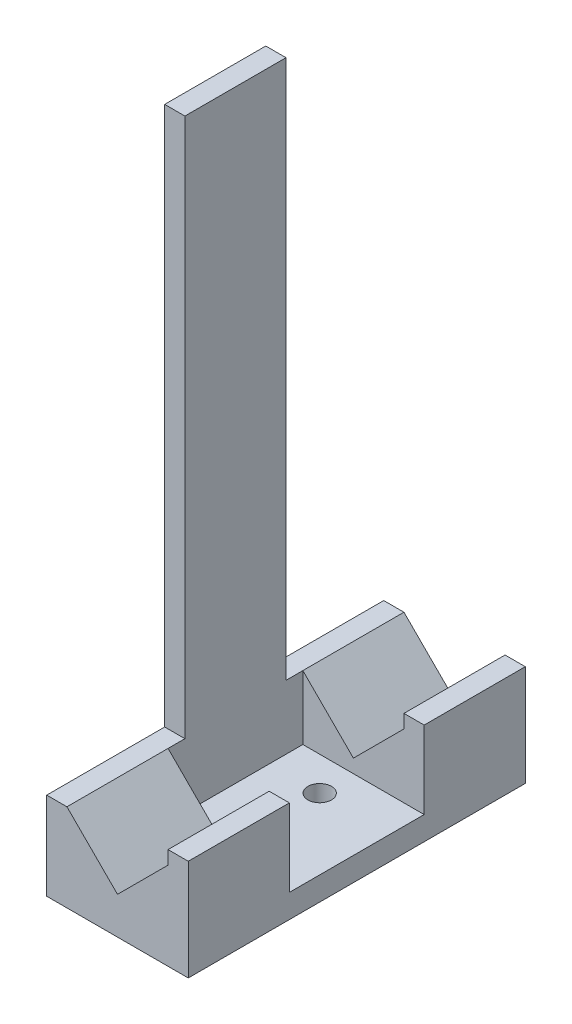
ISO-10303-21;
HEADER;
FILE_DESCRIPTION(('STEP AP214'),'2;1');
FILE_NAME('part.step','',(''),(''),'','','');
FILE_SCHEMA(('AUTOMOTIVE_DESIGN { 1 0 10303 214 1 1 1 1 }'));
ENDSEC;
DATA;
#1=APPLICATION_CONTEXT('core data for automotive mechanical design processes');
#2=APPLICATION_PROTOCOL_DEFINITION('international standard','automotive_design',2000,#1);
#3=PRODUCT_CONTEXT('',#1,'mechanical');
#4=PRODUCT('Part','Part','',(#3));
#5=PRODUCT_RELATED_PRODUCT_CATEGORY('part','',(#4));
#6=PRODUCT_DEFINITION_FORMATION('','',#4);
#7=PRODUCT_DEFINITION_CONTEXT('part definition',#1,'design');
#8=PRODUCT_DEFINITION('design','',#6,#7);
#9=PRODUCT_DEFINITION_SHAPE('','',#8);
#10=(LENGTH_UNIT() NAMED_UNIT(*) SI_UNIT(.MILLI.,.METRE.));
#11=(NAMED_UNIT(*) PLANE_ANGLE_UNIT() SI_UNIT($,.RADIAN.));
#12=(NAMED_UNIT(*) SI_UNIT($,.STERADIAN.) SOLID_ANGLE_UNIT());
#13=UNCERTAINTY_MEASURE_WITH_UNIT(LENGTH_MEASURE(1.E-05),#10,'distance_accuracy_value','');
#14=(GEOMETRIC_REPRESENTATION_CONTEXT(3) GLOBAL_UNCERTAINTY_ASSIGNED_CONTEXT((#13)) GLOBAL_UNIT_ASSIGNED_CONTEXT((#10,
#11,#12)) REPRESENTATION_CONTEXT('',''));
#15=CARTESIAN_POINT('',(0.,0.,0.));
#16=DIRECTION('',(0.,0.,1.));
#17=DIRECTION('',(1.,0.,0.));
#18=AXIS2_PLACEMENT_3D('',#15,#16,#17);
#19=CARTESIAN_POINT('',(18.0000000000001,15.,50.));
#20=DIRECTION('',(0.,-1.,0.));
#21=DIRECTION('',(1.,0.,0.));
#22=AXIS2_PLACEMENT_3D('',#19,#20,#21);
#23=PLANE('',#22);
#24=DIRECTION('',(0.,0.,-1.));
#25=VECTOR('',#24,1.);
#26=CARTESIAN_POINT('',(18.0000000000001,15.,50.));
#27=LINE('',#26,#25);
#28=CARTESIAN_POINT('',(18.0000000000001,15.,15.));
#29=VERTEX_POINT('',#28);
#30=CARTESIAN_POINT('',(18.0000000000001,15.,0.));
#31=VERTEX_POINT('',#30);
#32=EDGE_CURVE('E238',#29,#31,#27,.T.);
#33=ORIENTED_EDGE('',*,*,#32,.F.);
#34=DIRECTION('',(1.,0.,0.));
#35=VECTOR('',#34,1.);
#36=CARTESIAN_POINT('',(-20.0705439901186,15.,15.));
#37=LINE('',#36,#35);
#38=CARTESIAN_POINT('',(21.0000000000001,15.,15.));
#39=VERTEX_POINT('',#38);
#40=EDGE_CURVE('E288',#29,#39,#37,.T.);
#41=ORIENTED_EDGE('',*,*,#40,.T.);
#42=DIRECTION('',(0.,0.,-1.));
#43=VECTOR('',#42,1.);
#44=CARTESIAN_POINT('',(21.0000000000001,15.,50.));
#45=LINE('',#44,#43);
#46=CARTESIAN_POINT('',(21.0000000000001,15.,0.));
#47=VERTEX_POINT('',#46);
#48=EDGE_CURVE('E242',#39,#47,#45,.T.);
#49=ORIENTED_EDGE('',*,*,#48,.T.);
#50=DIRECTION('',(-1.,0.,0.));
#51=VECTOR('',#50,1.);
#52=CARTESIAN_POINT('',(18.0000000000001,15.,0.));
#53=LINE('',#52,#51);
#54=EDGE_CURVE('E354',#47,#31,#53,.T.);
#55=ORIENTED_EDGE('',*,*,#54,.T.);
#56=EDGE_LOOP('',(#33,#41,#49,#55));
#57=FACE_BOUND('',#56,.T.);
#58=ADVANCED_FACE('F32',(#57),#23,.F.);
#59=CARTESIAN_POINT('',(18.0000000000001,13.,50.));
#60=DIRECTION('',(1.,0.,0.));
#61=DIRECTION('',(0.,1.,0.));
#62=AXIS2_PLACEMENT_3D('',#59,#60,#61);
#63=PLANE('',#62);
#64=DIRECTION('',(0.,0.,-1.));
#65=VECTOR('',#64,1.);
#66=CARTESIAN_POINT('',(18.0000000000001,13.,50.));
#67=LINE('',#66,#65);
#68=CARTESIAN_POINT('',(18.0000000000001,13.,15.));
#69=VERTEX_POINT('',#68);
#70=CARTESIAN_POINT('',(18.0000000000001,13.,0.));
#71=VERTEX_POINT('',#70);
#72=EDGE_CURVE('E234',#69,#71,#67,.T.);
#73=ORIENTED_EDGE('',*,*,#72,.F.);
#74=DIRECTION('',(0.,1.,0.));
#75=VECTOR('',#74,1.);
#76=CARTESIAN_POINT('',(18.0000000000001,13.,15.));
#77=LINE('',#76,#75);
#78=EDGE_CURVE('E303',#69,#29,#77,.T.);
#79=ORIENTED_EDGE('',*,*,#78,.T.);
#80=ORIENTED_EDGE('',*,*,#32,.T.);
#81=DIRECTION('',(0.,-1.,0.));
#82=VECTOR('',#81,1.);
#83=CARTESIAN_POINT('',(18.0000000000001,13.,0.));
#84=LINE('',#83,#82);
#85=EDGE_CURVE('E357',#31,#71,#84,.T.);
#86=ORIENTED_EDGE('',*,*,#85,.T.);
#87=EDGE_LOOP('',(#73,#79,#80,#86));
#88=FACE_BOUND('',#87,.T.);
#89=ADVANCED_FACE('F409',(#88),#63,.F.);
#90=CARTESIAN_POINT('',(18.0000000000001,13.,50.));
#91=DIRECTION('',(0.707106781186548,-0.707106781186547,0.));
#92=DIRECTION('',(0.707106781186547,0.707106781186548,0.));
#93=AXIS2_PLACEMENT_3D('',#90,#91,#92);
#94=PLANE('',#93);
#95=DIRECTION('',(0.,0.,-1.));
#96=VECTOR('',#95,1.);
#97=CARTESIAN_POINT('',(10.5000000000001,5.5,50.));
#98=LINE('',#97,#96);
#99=CARTESIAN_POINT('',(10.5000000000001,5.5,15.));
#100=VERTEX_POINT('',#99);
#101=CARTESIAN_POINT('',(10.5000000000001,5.5,0.));
#102=VERTEX_POINT('',#101);
#103=EDGE_CURVE('E230',#100,#102,#98,.T.);
#104=ORIENTED_EDGE('',*,*,#103,.F.);
#105=DIRECTION('',(0.707106781186547,0.707106781186548,0.));
#106=VECTOR('',#105,1.);
#107=CARTESIAN_POINT('',(18.0000000000001,13.,15.));
#108=LINE('',#107,#106);
#109=EDGE_CURVE('E300',#100,#69,#108,.T.);
#110=ORIENTED_EDGE('',*,*,#109,.T.);
#111=ORIENTED_EDGE('',*,*,#72,.T.);
#112=DIRECTION('',(-0.707106781186547,-0.707106781186548,0.));
#113=VECTOR('',#112,1.);
#114=CARTESIAN_POINT('',(18.0000000000001,13.,0.));
#115=LINE('',#114,#113);
#116=EDGE_CURVE('E360',#71,#102,#115,.T.);
#117=ORIENTED_EDGE('',*,*,#116,.T.);
#118=EDGE_LOOP('',(#104,#110,#111,#117));
#119=FACE_BOUND('',#118,.T.);
#120=ADVANCED_FACE('F415',(#119),#94,.F.);
#121=CARTESIAN_POINT('',(10.5000000000001,5.5,50.));
#122=DIRECTION('',(-0.707106781186548,-0.707106781186548,0.));
#123=DIRECTION('',(0.707106781186548,-0.707106781186548,0.));
#124=AXIS2_PLACEMENT_3D('',#121,#122,#123);
#125=PLANE('',#124);
#126=DIRECTION('',(0.,0.,-1.));
#127=VECTOR('',#126,1.);
#128=CARTESIAN_POINT('',(3.00000000000007,13.,0.));
#129=LINE('',#128,#127);
#130=CARTESIAN_POINT('',(3.00000000000006,13.,15.));
#131=VERTEX_POINT('',#130);
#132=CARTESIAN_POINT('',(3.00000000000006,13.,0.));
#133=VERTEX_POINT('',#132);
#134=EDGE_CURVE('E320',#131,#133,#129,.T.);
#135=ORIENTED_EDGE('',*,*,#134,.F.);
#136=DIRECTION('',(0.707106781186548,-0.707106781186548,0.));
#137=VECTOR('',#136,1.);
#138=CARTESIAN_POINT('',(10.5000000000001,5.5,15.));
#139=LINE('',#138,#137);
#140=EDGE_CURVE('E11',#131,#100,#139,.T.);
#141=ORIENTED_EDGE('',*,*,#140,.T.);
#142=ORIENTED_EDGE('',*,*,#103,.T.);
#143=DIRECTION('',(-0.707106781186548,0.707106781186548,0.));
#144=VECTOR('',#143,1.);
#145=CARTESIAN_POINT('',(10.5000000000001,5.5,0.));
#146=LINE('',#145,#144);
#147=EDGE_CURVE('E363',#102,#133,#146,.T.);
#148=ORIENTED_EDGE('',*,*,#147,.T.);
#149=EDGE_LOOP('',(#135,#141,#142,#148));
#150=FACE_BOUND('',#149,.T.);
#151=ADVANCED_FACE('F488',(#150),#125,.F.);
#152=CARTESIAN_POINT('',(0.,0.,50.));
#153=DIRECTION('',(0.,0.,-1.));
#154=DIRECTION('',(-1.,0.,0.));
#155=AXIS2_PLACEMENT_3D('',#152,#153,#154);
#156=PLANE('',#155);
#157=DIRECTION('',(1.,0.,0.));
#158=VECTOR('',#157,1.);
#159=CARTESIAN_POINT('',(0.,13.,50.));
#160=LINE('',#159,#158);
#161=CARTESIAN_POINT('',(0.,13.,50.));
#162=VERTEX_POINT('',#161);
#163=CARTESIAN_POINT('',(3.00000000000007,13.,50.));
#164=VERTEX_POINT('',#163);
#165=EDGE_CURVE('E249',#162,#164,#160,.T.);
#166=ORIENTED_EDGE('',*,*,#165,.F.);
#167=DIRECTION('',(0.,-1.,0.));
#168=VECTOR('',#167,1.);
#169=CARTESIAN_POINT('',(0.,4.,50.));
#170=LINE('',#169,#168);
#171=CARTESIAN_POINT('',(0.,0.,50.));
#172=VERTEX_POINT('',#171);
#173=EDGE_CURVE('E347',#162,#172,#170,.T.);
#174=ORIENTED_EDGE('',*,*,#173,.T.);
#175=DIRECTION('',(1.,0.,0.));
#176=VECTOR('',#175,1.);
#177=CARTESIAN_POINT('',(21.,0.,50.));
#178=LINE('',#177,#176);
#179=CARTESIAN_POINT('',(21.,0.,50.));
#180=VERTEX_POINT('',#179);
#181=EDGE_CURVE('E349',#172,#180,#178,.T.);
#182=ORIENTED_EDGE('',*,*,#181,.T.);
#183=DIRECTION('',(0.,1.,0.));
#184=VECTOR('',#183,1.);
#185=CARTESIAN_POINT('',(21.,0.,50.));
#186=LINE('',#185,#184);
#187=CARTESIAN_POINT('',(21.0000000000001,15.,50.));
#188=VERTEX_POINT('',#187);
#189=EDGE_CURVE('E334',#180,#188,#186,.T.);
#190=ORIENTED_EDGE('',*,*,#189,.T.);
#191=DIRECTION('',(-1.,0.,0.));
#192=VECTOR('',#191,1.);
#193=CARTESIAN_POINT('',(18.0000000000001,15.,50.));
#194=LINE('',#193,#192);
#195=CARTESIAN_POINT('',(18.0000000000001,15.,50.));
#196=VERTEX_POINT('',#195);
#197=EDGE_CURVE('E337',#188,#196,#194,.T.);
#198=ORIENTED_EDGE('',*,*,#197,.T.);
#199=DIRECTION('',(0.,-1.,0.));
#200=VECTOR('',#199,1.);
#201=CARTESIAN_POINT('',(18.0000000000001,13.,50.));
#202=LINE('',#201,#200);
#203=CARTESIAN_POINT('',(18.0000000000001,13.,50.));
#204=VERTEX_POINT('',#203);
#205=EDGE_CURVE('E340',#196,#204,#202,.T.);
#206=ORIENTED_EDGE('',*,*,#205,.T.);
#207=DIRECTION('',(-0.707106781186547,-0.707106781186548,0.));
#208=VECTOR('',#207,1.);
#209=CARTESIAN_POINT('',(18.0000000000001,13.,50.));
#210=LINE('',#209,#208);
#211=CARTESIAN_POINT('',(10.5000000000001,5.5,50.));
#212=VERTEX_POINT('',#211);
#213=EDGE_CURVE('E342',#204,#212,#210,.T.);
#214=ORIENTED_EDGE('',*,*,#213,.T.);
#215=DIRECTION('',(-0.707106781186548,0.707106781186548,0.));
#216=VECTOR('',#215,1.);
#217=CARTESIAN_POINT('',(10.5000000000001,5.5,50.));
#218=LINE('',#217,#216);
#219=EDGE_CURVE('E344',#212,#164,#218,.T.);
#220=ORIENTED_EDGE('',*,*,#219,.T.);
#221=EDGE_LOOP('',(#166,#174,#182,#190,#198,#206,#214,#220));
#222=FACE_BOUND('',#221,.T.);
#223=ADVANCED_FACE('F450',(#222),#156,.F.);
#224=CARTESIAN_POINT('',(0.,0.,0.));
#225=DIRECTION('',(0.,0.,-1.));
#226=DIRECTION('',(-1.,0.,0.));
#227=AXIS2_PLACEMENT_3D('',#224,#225,#226);
#228=PLANE('',#227);
#229=DIRECTION('',(0.,-1.,0.));
#230=VECTOR('',#229,1.);
#231=CARTESIAN_POINT('',(0.,4.,0.));
#232=LINE('',#231,#230);
#233=CARTESIAN_POINT('',(1.01481323344643E-13,13.,0.));
#234=VERTEX_POINT('',#233);
#235=CARTESIAN_POINT('',(0.,0.,0.));
#236=VERTEX_POINT('',#235);
#237=EDGE_CURVE('E366',#234,#236,#232,.T.);
#238=ORIENTED_EDGE('',*,*,#237,.F.);
#239=DIRECTION('',(-1.,0.,0.));
#240=VECTOR('',#239,1.);
#241=CARTESIAN_POINT('',(-2.99999999999952,13.,0.));
#242=LINE('',#241,#240);
#243=EDGE_CURVE('E324',#133,#234,#242,.T.);
#244=ORIENTED_EDGE('',*,*,#243,.F.);
#245=ORIENTED_EDGE('',*,*,#147,.F.);
#246=ORIENTED_EDGE('',*,*,#116,.F.);
#247=ORIENTED_EDGE('',*,*,#85,.F.);
#248=ORIENTED_EDGE('',*,*,#54,.F.);
#249=DIRECTION('',(0.,1.,0.));
#250=VECTOR('',#249,1.);
#251=CARTESIAN_POINT('',(21.,0.,0.));
#252=LINE('',#251,#250);
#253=CARTESIAN_POINT('',(21.,0.,0.));
#254=VERTEX_POINT('',#253);
#255=EDGE_CURVE('E333',#254,#47,#252,.T.);
#256=ORIENTED_EDGE('',*,*,#255,.F.);
#257=DIRECTION('',(1.,0.,0.));
#258=VECTOR('',#257,1.);
#259=CARTESIAN_POINT('',(21.,0.,0.));
#260=LINE('',#259,#258);
#261=EDGE_CURVE('E338',#236,#254,#260,.T.);
#262=ORIENTED_EDGE('',*,*,#261,.F.);
#263=EDGE_LOOP('',(#238,#244,#245,#246,#247,#248,#256,#262));
#264=FACE_BOUND('',#263,.T.);
#265=ADVANCED_FACE('F428',(#264),#228,.T.);
#266=CARTESIAN_POINT('',(21.,0.,50.));
#267=DIRECTION('',(-1.,0.,0.));
#268=DIRECTION('',(0.,-1.,0.));
#269=AXIS2_PLACEMENT_3D('',#266,#267,#268);
#270=PLANE('',#269);
#271=ORIENTED_EDGE('',*,*,#48,.F.);
#272=DIRECTION('',(0.,1.,0.));
#273=VECTOR('',#272,1.);
#274=CARTESIAN_POINT('',(21.0000000000001,15.,15.));
#275=LINE('',#274,#273);
#276=CARTESIAN_POINT('',(21.,3.49999999999998,15.));
#277=VERTEX_POINT('',#276);
#278=EDGE_CURVE('E273',#277,#39,#275,.T.);
#279=ORIENTED_EDGE('',*,*,#278,.F.);
#280=DIRECTION('',(0.,0.,-1.));
#281=VECTOR('',#280,1.);
#282=CARTESIAN_POINT('',(21.,3.49999999999998,35.));
#283=LINE('',#282,#281);
#284=CARTESIAN_POINT('',(21.,3.49999999999998,35.));
#285=VERTEX_POINT('',#284);
#286=EDGE_CURVE('E262',#285,#277,#283,.T.);
#287=ORIENTED_EDGE('',*,*,#286,.F.);
#288=DIRECTION('',(0.,-1.,0.));
#289=VECTOR('',#288,1.);
#290=CARTESIAN_POINT('',(21.0000000000001,15.,35.));
#291=LINE('',#290,#289);
#292=CARTESIAN_POINT('',(21.0000000000001,15.,35.));
#293=VERTEX_POINT('',#292);
#294=EDGE_CURVE('E257',#293,#285,#291,.T.);
#295=ORIENTED_EDGE('',*,*,#294,.F.);
#296=EDGE_CURVE('E243',#188,#293,#45,.T.);
#297=ORIENTED_EDGE('',*,*,#296,.F.);
#298=ORIENTED_EDGE('',*,*,#189,.F.);
#299=DIRECTION('',(0.,0.,-1.));
#300=VECTOR('',#299,1.);
#301=CARTESIAN_POINT('',(21.,0.,50.));
#302=LINE('',#301,#300);
#303=EDGE_CURVE('E351',#180,#254,#302,.T.);
#304=ORIENTED_EDGE('',*,*,#303,.T.);
#305=ORIENTED_EDGE('',*,*,#255,.T.);
#306=EDGE_LOOP('',(#271,#279,#287,#295,#297,#298,#304,#305));
#307=FACE_BOUND('',#306,.T.);
#308=ADVANCED_FACE('F34',(#307),#270,.F.);
#309=ORIENTED_EDGE('',*,*,#296,.T.);
#310=DIRECTION('',(1.,0.,0.));
#311=VECTOR('',#310,1.);
#312=CARTESIAN_POINT('',(-20.0705439901186,15.,35.));
#313=LINE('',#312,#311);
#314=CARTESIAN_POINT('',(18.0000000000001,15.,35.));
#315=VERTEX_POINT('',#314);
#316=EDGE_CURVE('E284',#315,#293,#313,.T.);
#317=ORIENTED_EDGE('',*,*,#316,.F.);
#318=EDGE_CURVE('E239',#196,#315,#27,.T.);
#319=ORIENTED_EDGE('',*,*,#318,.F.);
#320=ORIENTED_EDGE('',*,*,#197,.F.);
#321=EDGE_LOOP('',(#309,#317,#319,#320));
#322=FACE_BOUND('',#321,.T.);
#323=ADVANCED_FACE('F411',(#322),#23,.F.);
#324=ORIENTED_EDGE('',*,*,#318,.T.);
#325=DIRECTION('',(0.,-1.,0.));
#326=VECTOR('',#325,1.);
#327=CARTESIAN_POINT('',(18.0000000000001,13.,35.));
#328=LINE('',#327,#326);
#329=CARTESIAN_POINT('',(18.0000000000001,13.,35.));
#330=VERTEX_POINT('',#329);
#331=EDGE_CURVE('E297',#315,#330,#328,.T.);
#332=ORIENTED_EDGE('',*,*,#331,.T.);
#333=EDGE_CURVE('E235',#204,#330,#67,.T.);
#334=ORIENTED_EDGE('',*,*,#333,.F.);
#335=ORIENTED_EDGE('',*,*,#205,.F.);
#336=EDGE_LOOP('',(#324,#332,#334,#335));
#337=FACE_BOUND('',#336,.T.);
#338=ADVANCED_FACE('F418',(#337),#63,.F.);
#339=ORIENTED_EDGE('',*,*,#333,.T.);
#340=DIRECTION('',(-0.707106781186547,-0.707106781186548,0.));
#341=VECTOR('',#340,1.);
#342=CARTESIAN_POINT('',(18.0000000000001,13.,35.));
#343=LINE('',#342,#341);
#344=CARTESIAN_POINT('',(10.5000000000001,5.5,35.));
#345=VERTEX_POINT('',#344);
#346=EDGE_CURVE('E294',#330,#345,#343,.T.);
#347=ORIENTED_EDGE('',*,*,#346,.T.);
#348=EDGE_CURVE('E231',#212,#345,#98,.T.);
#349=ORIENTED_EDGE('',*,*,#348,.F.);
#350=ORIENTED_EDGE('',*,*,#213,.F.);
#351=EDGE_LOOP('',(#339,#347,#349,#350));
#352=FACE_BOUND('',#351,.T.);
#353=ADVANCED_FACE('F426',(#352),#94,.F.);
#354=ORIENTED_EDGE('',*,*,#348,.T.);
#355=DIRECTION('',(-0.707106781186548,0.707106781186548,0.));
#356=VECTOR('',#355,1.);
#357=CARTESIAN_POINT('',(10.5000000000001,5.5,35.));
#358=LINE('',#357,#356);
#359=CARTESIAN_POINT('',(3.00000000000006,13.,35.));
#360=VERTEX_POINT('',#359);
#361=EDGE_CURVE('E41',#345,#360,#358,.T.);
#362=ORIENTED_EDGE('',*,*,#361,.T.);
#363=DIRECTION('',(0.,0.,-1.));
#364=VECTOR('',#363,1.);
#365=CARTESIAN_POINT('',(3.00000000000006,13.,50.));
#366=LINE('',#365,#364);
#367=EDGE_CURVE('E227',#164,#360,#366,.T.);
#368=ORIENTED_EDGE('',*,*,#367,.F.);
#369=ORIENTED_EDGE('',*,*,#219,.F.);
#370=EDGE_LOOP('',(#354,#362,#368,#369));
#371=FACE_BOUND('',#370,.T.);
#372=ADVANCED_FACE('F475',(#371),#125,.F.);
#373=CARTESIAN_POINT('',(3.00000000000006,13.,50.));
#374=DIRECTION('',(-1.,0.,0.));
#375=DIRECTION('',(0.,-1.,0.));
#376=AXIS2_PLACEMENT_3D('',#373,#374,#375);
#377=PLANE('',#376);
#378=DIRECTION('',(0.,0.,-1.));
#379=VECTOR('',#378,1.);
#380=CARTESIAN_POINT('',(3.00000000000019,93.,50.));
#381=LINE('',#380,#379);
#382=CARTESIAN_POINT('',(3.00000000000044,93.,32.5));
#383=VERTEX_POINT('',#382);
#384=CARTESIAN_POINT('',(3.00000000000044,93.,17.5));
#385=VERTEX_POINT('',#384);
#386=EDGE_CURVE('E218',#383,#385,#381,.T.);
#387=ORIENTED_EDGE('',*,*,#386,.F.);
#388=DIRECTION('',(0.,1.,0.));
#389=VECTOR('',#388,1.);
#390=CARTESIAN_POINT('',(3.00000000000007,13.,32.5));
#391=LINE('',#390,#389);
#392=CARTESIAN_POINT('',(3.00000000000007,13.,32.5));
#393=VERTEX_POINT('',#392);
#394=EDGE_CURVE('E310',#393,#383,#391,.T.);
#395=ORIENTED_EDGE('',*,*,#394,.F.);
#396=EDGE_CURVE('E226',#360,#393,#366,.T.);
#397=ORIENTED_EDGE('',*,*,#396,.F.);
#398=DIRECTION('',(0.,-1.,0.));
#399=VECTOR('',#398,1.);
#400=CARTESIAN_POINT('',(3.00000000000007,15.,35.));
#401=LINE('',#400,#399);
#402=CARTESIAN_POINT('',(3.00000000000005,3.49999999999999,35.));
#403=VERTEX_POINT('',#402);
#404=EDGE_CURVE('E281',#360,#403,#401,.T.);
#405=ORIENTED_EDGE('',*,*,#404,.T.);
#406=DIRECTION('',(0.,0.,-1.));
#407=VECTOR('',#406,1.);
#408=CARTESIAN_POINT('',(3.00000000000005,3.49999999999999,35.));
#409=LINE('',#408,#407);
#410=CARTESIAN_POINT('',(3.00000000000005,3.49999999999999,15.));
#411=VERTEX_POINT('',#410);
#412=EDGE_CURVE('E275',#403,#411,#409,.T.);
#413=ORIENTED_EDGE('',*,*,#412,.T.);
#414=DIRECTION('',(0.,1.,0.));
#415=VECTOR('',#414,1.);
#416=CARTESIAN_POINT('',(3.00000000000007,15.,15.));
#417=LINE('',#416,#415);
#418=EDGE_CURVE('E285',#411,#131,#417,.T.);
#419=ORIENTED_EDGE('',*,*,#418,.T.);
#420=CARTESIAN_POINT('',(3.00000000000006,13.,17.5));
#421=VERTEX_POINT('',#420);
#422=EDGE_CURVE('E321',#421,#131,#129,.T.);
#423=ORIENTED_EDGE('',*,*,#422,.F.);
#424=DIRECTION('',(0.,1.,0.));
#425=VECTOR('',#424,1.);
#426=CARTESIAN_POINT('',(3.00000000000007,13.,17.5));
#427=LINE('',#426,#425);
#428=EDGE_CURVE('E327',#421,#385,#427,.T.);
#429=ORIENTED_EDGE('',*,*,#428,.T.);
#430=EDGE_LOOP('',(#387,#395,#397,#405,#413,#419,#423,#429));
#431=FACE_BOUND('',#430,.T.);
#432=ADVANCED_FACE('F471',(#431),#377,.F.);
#433=CARTESIAN_POINT('',(3.00000000000019,93.,50.));
#434=DIRECTION('',(0.,-1.,0.));
#435=DIRECTION('',(1.,0.,0.));
#436=AXIS2_PLACEMENT_3D('',#433,#434,#435);
#437=PLANE('',#436);
#438=DIRECTION('',(0.,0.,-1.));
#439=VECTOR('',#438,1.);
#440=CARTESIAN_POINT('',(1.9298798670242E-13,93.,50.));
#441=LINE('',#440,#439);
#442=CARTESIAN_POINT('',(1.9298798670242E-13,93.,32.5));
#443=VERTEX_POINT('',#442);
#444=CARTESIAN_POINT('',(1.9298798670242E-13,93.,17.5));
#445=VERTEX_POINT('',#444);
#446=EDGE_CURVE('E216',#443,#445,#441,.T.);
#447=ORIENTED_EDGE('',*,*,#446,.F.);
#448=DIRECTION('',(-1.,0.,0.));
#449=VECTOR('',#448,1.);
#450=CARTESIAN_POINT('',(-2.99999999999914,93.,32.5));
#451=LINE('',#450,#449);
#452=EDGE_CURVE('E306',#383,#443,#451,.T.);
#453=ORIENTED_EDGE('',*,*,#452,.F.);
#454=ORIENTED_EDGE('',*,*,#386,.T.);
#455=DIRECTION('',(1.,0.,0.));
#456=VECTOR('',#455,1.);
#457=CARTESIAN_POINT('',(-2.99999999999914,93.,17.5));
#458=LINE('',#457,#456);
#459=EDGE_CURVE('E316',#445,#385,#458,.T.);
#460=ORIENTED_EDGE('',*,*,#459,.F.);
#461=EDGE_LOOP('',(#447,#453,#454,#460));
#462=FACE_BOUND('',#461,.T.);
#463=ADVANCED_FACE('F505',(#462),#437,.F.);
#464=CARTESIAN_POINT('',(-2.99999999999999,4.,50.));
#465=DIRECTION('',(0.832050294337844,-0.554700196225229,0.));
#466=DIRECTION('',(0.554700196225229,0.832050294337844,0.));
#467=AXIS2_PLACEMENT_3D('',#464,#465,#466);
#468=PLANE('',#467);
#469=DIRECTION('',(0.,0.,-1.));
#470=VECTOR('',#469,1.);
#471=CARTESIAN_POINT('',(0.,8.5,50.));
#472=LINE('',#471,#470);
#473=CARTESIAN_POINT('',(0.,8.5,27.5));
#474=VERTEX_POINT('',#473);
#475=CARTESIAN_POINT('',(0.,8.5,22.5));
#476=VERTEX_POINT('',#475);
#477=EDGE_CURVE('E208',#474,#476,#472,.T.);
#478=ORIENTED_EDGE('',*,*,#477,.T.);
#479=DIRECTION('',(-0.554700196225229,-0.832050294337844,0.));
#480=VECTOR('',#479,1.);
#481=CARTESIAN_POINT('',(-2.99999999999999,4.,22.5));
#482=LINE('',#481,#480);
#483=CARTESIAN_POINT('',(-2.99999999999999,4.,22.5));
#484=VERTEX_POINT('',#483);
#485=EDGE_CURVE('E265',#476,#484,#482,.T.);
#486=ORIENTED_EDGE('',*,*,#485,.T.);
#487=DIRECTION('',(0.,0.,-1.));
#488=VECTOR('',#487,1.);
#489=CARTESIAN_POINT('',(-2.99999999999999,4.,50.));
#490=LINE('',#489,#488);
#491=CARTESIAN_POINT('',(-2.99999999999999,4.,27.5));
#492=VERTEX_POINT('',#491);
#493=EDGE_CURVE('E210',#492,#484,#490,.T.);
#494=ORIENTED_EDGE('',*,*,#493,.F.);
#495=DIRECTION('',(0.554700196225229,0.832050294337844,0.));
#496=VECTOR('',#495,1.);
#497=CARTESIAN_POINT('',(-2.99999999999999,4.,27.5));
#498=LINE('',#497,#496);
#499=EDGE_CURVE('E196',#492,#474,#498,.T.);
#500=ORIENTED_EDGE('',*,*,#499,.T.);
#501=EDGE_LOOP('',(#478,#486,#494,#500));
#502=FACE_BOUND('',#501,.T.);
#503=ADVANCED_FACE('F206',(#502),#468,.F.);
#504=CARTESIAN_POINT('',(-2.99999999999999,0.999999999999997,50.));
#505=DIRECTION('',(1.,0.,0.));
#506=DIRECTION('',(0.,1.,0.));
#507=AXIS2_PLACEMENT_3D('',#504,#505,#506);
#508=PLANE('',#507);
#509=ORIENTED_EDGE('',*,*,#493,.T.);
#510=DIRECTION('',(0.,1.,0.));
#511=VECTOR('',#510,1.);
#512=CARTESIAN_POINT('',(-2.99999999999999,0.,22.5));
#513=LINE('',#512,#511);
#514=CARTESIAN_POINT('',(-2.99999999999999,0.999999999999997,22.5));
#515=VERTEX_POINT('',#514);
#516=EDGE_CURVE('E388',#515,#484,#513,.T.);
#517=ORIENTED_EDGE('',*,*,#516,.F.);
#518=DIRECTION('',(0.,0.,-1.));
#519=VECTOR('',#518,1.);
#520=CARTESIAN_POINT('',(-2.99999999999999,0.999999999999997,50.));
#521=LINE('',#520,#519);
#522=CARTESIAN_POINT('',(-2.99999999999999,0.999999999999997,27.5));
#523=VERTEX_POINT('',#522);
#524=EDGE_CURVE('E220',#523,#515,#521,.T.);
#525=ORIENTED_EDGE('',*,*,#524,.F.);
#526=DIRECTION('',(0.,1.,0.));
#527=VECTOR('',#526,1.);
#528=CARTESIAN_POINT('',(-2.99999999999999,0.,27.5));
#529=LINE('',#528,#527);
#530=EDGE_CURVE('E201',#523,#492,#529,.T.);
#531=ORIENTED_EDGE('',*,*,#530,.T.);
#532=EDGE_LOOP('',(#509,#517,#525,#531));
#533=FACE_BOUND('',#532,.T.);
#534=ADVANCED_FACE('F387',(#533),#508,.F.);
#535=CARTESIAN_POINT('',(-2.99999999999999,0.999999999999997,50.));
#536=DIRECTION('',(0.,1.,0.));
#537=DIRECTION('',(0.,0.,1.));
#538=AXIS2_PLACEMENT_3D('',#535,#536,#537);
#539=PLANE('',#538);
#540=ORIENTED_EDGE('',*,*,#524,.T.);
#541=DIRECTION('',(1.,0.,0.));
#542=VECTOR('',#541,1.);
#543=CARTESIAN_POINT('',(-2.99999999999999,0.999999999999997,22.5));
#544=LINE('',#543,#542);
#545=CARTESIAN_POINT('',(-1.99999999999999,0.999999999999997,22.5));
#546=VERTEX_POINT('',#545);
#547=EDGE_CURVE('E269',#515,#546,#544,.T.);
#548=ORIENTED_EDGE('',*,*,#547,.T.);
#549=DIRECTION('',(0.,0.,-1.));
#550=VECTOR('',#549,1.);
#551=CARTESIAN_POINT('',(-1.99999999999999,0.999999999999997,50.));
#552=LINE('',#551,#550);
#553=CARTESIAN_POINT('',(-1.99999999999999,0.999999999999997,27.5));
#554=VERTEX_POINT('',#553);
#555=EDGE_CURVE('E376',#554,#546,#552,.T.);
#556=ORIENTED_EDGE('',*,*,#555,.F.);
#557=DIRECTION('',(-1.,0.,0.));
#558=VECTOR('',#557,1.);
#559=CARTESIAN_POINT('',(-2.99999999999999,0.999999999999997,27.5));
#560=LINE('',#559,#558);
#561=EDGE_CURVE('E212',#554,#523,#560,.T.);
#562=ORIENTED_EDGE('',*,*,#561,.T.);
#563=EDGE_LOOP('',(#540,#548,#556,#562));
#564=FACE_BOUND('',#563,.T.);
#565=ADVANCED_FACE('F383',(#564),#539,.F.);
#566=CARTESIAN_POINT('',(-1.99999999999999,0.999999999999997,50.));
#567=DIRECTION('',(-0.832050294337843,0.554700196225229,0.));
#568=DIRECTION('',(-0.554700196225229,-0.832050294337844,0.));
#569=AXIS2_PLACEMENT_3D('',#566,#567,#568);
#570=PLANE('',#569);
#571=ORIENTED_EDGE('',*,*,#555,.T.);
#572=DIRECTION('',(0.554700196225229,0.832050294337844,0.));
#573=VECTOR('',#572,1.);
#574=CARTESIAN_POINT('',(-1.99999999999999,0.999999999999997,22.5));
#575=LINE('',#574,#573);
#576=CARTESIAN_POINT('',(0.,4.,22.5));
#577=VERTEX_POINT('',#576);
#578=EDGE_CURVE('E211',#546,#577,#575,.T.);
#579=ORIENTED_EDGE('',*,*,#578,.T.);
#580=DIRECTION('',(0.,0.,-1.));
#581=VECTOR('',#580,1.);
#582=CARTESIAN_POINT('',(0.,4.,50.));
#583=LINE('',#582,#581);
#584=CARTESIAN_POINT('',(0.,4.,27.5));
#585=VERTEX_POINT('',#584);
#586=EDGE_CURVE('E374',#585,#577,#583,.T.);
#587=ORIENTED_EDGE('',*,*,#586,.F.);
#588=DIRECTION('',(-0.554700196225229,-0.832050294337844,0.));
#589=VECTOR('',#588,1.);
#590=CARTESIAN_POINT('',(-1.99999999999999,0.999999999999997,27.5));
#591=LINE('',#590,#589);
#592=EDGE_CURVE('E199',#585,#554,#591,.T.);
#593=ORIENTED_EDGE('',*,*,#592,.T.);
#594=EDGE_LOOP('',(#571,#579,#587,#593));
#595=FACE_BOUND('',#594,.T.);
#596=ADVANCED_FACE('F398',(#595),#570,.F.);
#597=CARTESIAN_POINT('',(0.,4.,50.));
#598=DIRECTION('',(1.,0.,0.));
#599=DIRECTION('',(0.,1.,0.));
#600=AXIS2_PLACEMENT_3D('',#597,#598,#599);
#601=PLANE('',#600);
#602=DIRECTION('',(0.,1.,0.));
#603=VECTOR('',#602,1.);
#604=CARTESIAN_POINT('',(0.,0.,22.5));
#605=LINE('',#604,#603);
#606=EDGE_CURVE('E49',#577,#476,#605,.T.);
#607=ORIENTED_EDGE('',*,*,#606,.T.);
#608=ORIENTED_EDGE('',*,*,#477,.F.);
#609=DIRECTION('',(0.,1.,0.));
#610=VECTOR('',#609,1.);
#611=CARTESIAN_POINT('',(0.,0.,27.5));
#612=LINE('',#611,#610);
#613=EDGE_CURVE('E57',#585,#474,#612,.T.);
#614=ORIENTED_EDGE('',*,*,#613,.F.);
#615=ORIENTED_EDGE('',*,*,#586,.T.);
#616=EDGE_LOOP('',(#607,#608,#614,#615));
#617=FACE_BOUND('',#616,.T.);
#618=ORIENTED_EDGE('',*,*,#446,.T.);
#619=DIRECTION('',(0.,-1.,0.));
#620=VECTOR('',#619,1.);
#621=CARTESIAN_POINT('',(1.9298798670242E-13,93.,17.5));
#622=LINE('',#621,#620);
#623=CARTESIAN_POINT('',(0.,13.,17.5));
#624=VERTEX_POINT('',#623);
#625=EDGE_CURVE('E246',#445,#624,#622,.T.);
#626=ORIENTED_EDGE('',*,*,#625,.T.);
#627=DIRECTION('',(0.,0.,1.));
#628=VECTOR('',#627,1.);
#629=CARTESIAN_POINT('',(0.,13.,50.));
#630=LINE('',#629,#628);
#631=EDGE_CURVE('E331',#234,#624,#630,.T.);
#632=ORIENTED_EDGE('',*,*,#631,.F.);
#633=ORIENTED_EDGE('',*,*,#237,.T.);
#634=DIRECTION('',(0.,0.,-1.));
#635=VECTOR('',#634,1.);
#636=CARTESIAN_POINT('',(0.,0.,50.));
#637=LINE('',#636,#635);
#638=EDGE_CURVE('E372',#172,#236,#637,.T.);
#639=ORIENTED_EDGE('',*,*,#638,.F.);
#640=ORIENTED_EDGE('',*,*,#173,.F.);
#641=DIRECTION('',(0.,0.,1.));
#642=VECTOR('',#641,1.);
#643=CARTESIAN_POINT('',(0.,13.,50.));
#644=LINE('',#643,#642);
#645=CARTESIAN_POINT('',(0.,13.,32.5));
#646=VERTEX_POINT('',#645);
#647=EDGE_CURVE('E313',#646,#162,#644,.T.);
#648=ORIENTED_EDGE('',*,*,#647,.F.);
#649=DIRECTION('',(0.,1.,0.));
#650=VECTOR('',#649,1.);
#651=CARTESIAN_POINT('',(1.9298798670242E-13,93.,32.5));
#652=LINE('',#651,#650);
#653=EDGE_CURVE('E251',#646,#443,#652,.T.);
#654=ORIENTED_EDGE('',*,*,#653,.T.);
#655=EDGE_LOOP('',(#618,#626,#632,#633,#639,#640,#648,#654));
#656=FACE_BOUND('',#655,.T.);
#657=ADVANCED_FACE('F214',(#617,#656),#601,.F.);
#658=CARTESIAN_POINT('',(21.,0.,50.));
#659=DIRECTION('',(0.,1.,0.));
#660=DIRECTION('',(-1.,0.,0.));
#661=AXIS2_PLACEMENT_3D('',#658,#659,#660);
#662=PLANE('',#661);
#663=CARTESIAN_POINT('',(10.5000000000001,0.,30.));
#664=DIRECTION('',(0.,1.,0.));
#665=DIRECTION('',(-1.,0.,0.));
#666=AXIS2_PLACEMENT_3D('',#663,#664,#665);
#667=CIRCLE('',#666,1.75);
#668=CARTESIAN_POINT('',(8.75000000000006,0.,30.));
#669=VERTEX_POINT('',#668);
#670=EDGE_CURVE('E390',#669,#669,#667,.T.);
#671=ORIENTED_EDGE('',*,*,#670,.T.);
#672=EDGE_LOOP('',(#671));
#673=FACE_BOUND('',#672,.T.);
#674=CARTESIAN_POINT('',(10.5000000000001,0.,20.));
#675=DIRECTION('',(0.,1.,0.));
#676=DIRECTION('',(-1.,0.,0.));
#677=AXIS2_PLACEMENT_3D('',#674,#675,#676);
#678=CIRCLE('',#677,1.75);
#679=CARTESIAN_POINT('',(8.75000000000006,0.,20.));
#680=VERTEX_POINT('',#679);
#681=EDGE_CURVE('E258',#680,#680,#678,.T.);
#682=ORIENTED_EDGE('',*,*,#681,.T.);
#683=EDGE_LOOP('',(#682));
#684=FACE_BOUND('',#683,.T.);
#685=ORIENTED_EDGE('',*,*,#261,.T.);
#686=ORIENTED_EDGE('',*,*,#303,.F.);
#687=ORIENTED_EDGE('',*,*,#181,.F.);
#688=ORIENTED_EDGE('',*,*,#638,.T.);
#689=EDGE_LOOP('',(#685,#686,#687,#688));
#690=FACE_BOUND('',#689,.T.);
#691=ADVANCED_FACE('F456',(#673,#684,#690),#662,.F.);
#692=CARTESIAN_POINT('',(-2.99999999999951,13.,17.5));
#693=DIRECTION('',(0.,0.,1.));
#694=DIRECTION('',(1.,0.,0.));
#695=AXIS2_PLACEMENT_3D('',#692,#693,#694);
#696=PLANE('',#695);
#697=ORIENTED_EDGE('',*,*,#459,.T.);
#698=ORIENTED_EDGE('',*,*,#428,.F.);
#699=DIRECTION('',(1.,0.,0.));
#700=VECTOR('',#699,1.);
#701=CARTESIAN_POINT('',(-2.99999999999951,13.,17.5));
#702=LINE('',#701,#700);
#703=EDGE_CURVE('E317',#624,#421,#702,.T.);
#704=ORIENTED_EDGE('',*,*,#703,.F.);
#705=ORIENTED_EDGE('',*,*,#625,.F.);
#706=EDGE_LOOP('',(#697,#698,#704,#705));
#707=FACE_BOUND('',#706,.T.);
#708=ADVANCED_FACE('F523',(#707),#696,.F.);
#709=CARTESIAN_POINT('',(0.,13.,0.));
#710=DIRECTION('',(0.,1.,0.));
#711=DIRECTION('',(-1.,0.,0.));
#712=AXIS2_PLACEMENT_3D('',#709,#710,#711);
#713=PLANE('',#712);
#714=ORIENTED_EDGE('',*,*,#631,.T.);
#715=ORIENTED_EDGE('',*,*,#703,.T.);
#716=ORIENTED_EDGE('',*,*,#422,.T.);
#717=ORIENTED_EDGE('',*,*,#134,.T.);
#718=ORIENTED_EDGE('',*,*,#243,.T.);
#719=EDGE_LOOP('',(#714,#715,#716,#717,#718));
#720=FACE_BOUND('',#719,.T.);
#721=ADVANCED_FACE('F485',(#720),#713,.T.);
#722=CARTESIAN_POINT('',(-2.99999999999951,13.,32.5));
#723=DIRECTION('',(0.,0.,-1.));
#724=DIRECTION('',(-1.,0.,0.));
#725=AXIS2_PLACEMENT_3D('',#722,#723,#724);
#726=PLANE('',#725);
#727=DIRECTION('',(-1.,0.,0.));
#728=VECTOR('',#727,1.);
#729=CARTESIAN_POINT('',(-2.99999999999951,13.,32.5));
#730=LINE('',#729,#728);
#731=EDGE_CURVE('E307',#393,#646,#730,.T.);
#732=ORIENTED_EDGE('',*,*,#731,.F.);
#733=ORIENTED_EDGE('',*,*,#394,.T.);
#734=ORIENTED_EDGE('',*,*,#452,.T.);
#735=ORIENTED_EDGE('',*,*,#653,.F.);
#736=EDGE_LOOP('',(#732,#733,#734,#735));
#737=FACE_BOUND('',#736,.T.);
#738=ADVANCED_FACE('F534',(#737),#726,.F.);
#739=CARTESIAN_POINT('',(0.,13.,0.));
#740=DIRECTION('',(0.,1.,0.));
#741=DIRECTION('',(-1.,0.,0.));
#742=AXIS2_PLACEMENT_3D('',#739,#740,#741);
#743=PLANE('',#742);
#744=ORIENTED_EDGE('',*,*,#647,.T.);
#745=ORIENTED_EDGE('',*,*,#165,.T.);
#746=ORIENTED_EDGE('',*,*,#367,.T.);
#747=ORIENTED_EDGE('',*,*,#396,.T.);
#748=ORIENTED_EDGE('',*,*,#731,.T.);
#749=EDGE_LOOP('',(#744,#745,#746,#747,#748));
#750=FACE_BOUND('',#749,.T.);
#751=ADVANCED_FACE('F477',(#750),#743,.T.);
#752=CARTESIAN_POINT('',(-20.0705439901186,15.,15.));
#753=DIRECTION('',(0.,0.,-1.));
#754=DIRECTION('',(-1.,0.,0.));
#755=AXIS2_PLACEMENT_3D('',#752,#753,#754);
#756=PLANE('',#755);
#757=ORIENTED_EDGE('',*,*,#109,.F.);
#758=ORIENTED_EDGE('',*,*,#140,.F.);
#759=ORIENTED_EDGE('',*,*,#418,.F.);
#760=DIRECTION('',(1.,0.,0.));
#761=VECTOR('',#760,1.);
#762=CARTESIAN_POINT('',(-20.0705439901186,3.50000000000002,15.));
#763=LINE('',#762,#761);
#764=EDGE_CURVE('E280',#411,#277,#763,.T.);
#765=ORIENTED_EDGE('',*,*,#764,.T.);
#766=ORIENTED_EDGE('',*,*,#278,.T.);
#767=ORIENTED_EDGE('',*,*,#40,.F.);
#768=ORIENTED_EDGE('',*,*,#78,.F.);
#769=EDGE_LOOP('',(#757,#758,#759,#765,#766,#767,#768));
#770=FACE_BOUND('',#769,.T.);
#771=ADVANCED_FACE('F464',(#770),#756,.F.);
#772=CARTESIAN_POINT('',(-20.0705439901186,15.,35.));
#773=DIRECTION('',(0.,0.,1.));
#774=DIRECTION('',(1.,0.,0.));
#775=AXIS2_PLACEMENT_3D('',#772,#773,#774);
#776=PLANE('',#775);
#777=ORIENTED_EDGE('',*,*,#316,.T.);
#778=ORIENTED_EDGE('',*,*,#294,.T.);
#779=DIRECTION('',(1.,0.,0.));
#780=VECTOR('',#779,1.);
#781=CARTESIAN_POINT('',(-20.0705439901186,3.50000000000002,35.));
#782=LINE('',#781,#780);
#783=EDGE_CURVE('E283',#403,#285,#782,.T.);
#784=ORIENTED_EDGE('',*,*,#783,.F.);
#785=ORIENTED_EDGE('',*,*,#404,.F.);
#786=ORIENTED_EDGE('',*,*,#361,.F.);
#787=ORIENTED_EDGE('',*,*,#346,.F.);
#788=ORIENTED_EDGE('',*,*,#331,.F.);
#789=EDGE_LOOP('',(#777,#778,#784,#785,#786,#787,#788));
#790=FACE_BOUND('',#789,.T.);
#791=ADVANCED_FACE('F440',(#790),#776,.F.);
#792=CARTESIAN_POINT('',(-20.0705439901186,3.50000000000002,35.));
#793=DIRECTION('',(0.,-1.,0.));
#794=DIRECTION('',(1.,0.,0.));
#795=AXIS2_PLACEMENT_3D('',#792,#793,#794);
#796=PLANE('',#795);
#797=CARTESIAN_POINT('',(10.5000000000001,3.49999999999999,30.));
#798=DIRECTION('',(0.,-1.,0.));
#799=DIRECTION('',(1.,0.,0.));
#800=AXIS2_PLACEMENT_3D('',#797,#798,#799);
#801=CIRCLE('',#800,1.75);
#802=CARTESIAN_POINT('',(12.2500000000001,3.49999999999999,30.));
#803=VERTEX_POINT('',#802);
#804=EDGE_CURVE('E36',#803,#803,#801,.T.);
#805=ORIENTED_EDGE('',*,*,#804,.T.);
#806=EDGE_LOOP('',(#805));
#807=FACE_BOUND('',#806,.T.);
#808=CARTESIAN_POINT('',(10.5000000000001,3.49999999999999,20.));
#809=DIRECTION('',(0.,-1.,0.));
#810=DIRECTION('',(1.,0.,0.));
#811=AXIS2_PLACEMENT_3D('',#808,#809,#810);
#812=CIRCLE('',#811,1.75);
#813=CARTESIAN_POINT('',(12.2500000000001,3.49999999999999,20.));
#814=VERTEX_POINT('',#813);
#815=EDGE_CURVE('E255',#814,#814,#812,.T.);
#816=ORIENTED_EDGE('',*,*,#815,.T.);
#817=EDGE_LOOP('',(#816));
#818=FACE_BOUND('',#817,.T.);
#819=ORIENTED_EDGE('',*,*,#783,.T.);
#820=ORIENTED_EDGE('',*,*,#286,.T.);
#821=ORIENTED_EDGE('',*,*,#764,.F.);
#822=ORIENTED_EDGE('',*,*,#412,.F.);
#823=EDGE_LOOP('',(#819,#820,#821,#822));
#824=FACE_BOUND('',#823,.T.);
#825=ADVANCED_FACE('F468',(#807,#818,#824),#796,.F.);
#826=CARTESIAN_POINT('',(10.5000000000001,0.,20.));
#827=DIRECTION('',(0.,1.,0.));
#828=DIRECTION('',(-1.,0.,0.));
#829=AXIS2_PLACEMENT_3D('',#826,#827,#828);
#830=CYLINDRICAL_SURFACE('',#829,1.75);
#831=ORIENTED_EDGE('',*,*,#681,.F.);
#832=EDGE_LOOP('',(#831));
#833=FACE_BOUND('',#832,.T.);
#834=ORIENTED_EDGE('',*,*,#815,.F.);
#835=EDGE_LOOP('',(#834));
#836=FACE_BOUND('',#835,.T.);
#837=ADVANCED_FACE('F542',(#833,#836),#830,.F.);
#838=CARTESIAN_POINT('',(10.5000000000001,0.,30.));
#839=DIRECTION('',(0.,1.,0.));
#840=DIRECTION('',(-1.,0.,0.));
#841=AXIS2_PLACEMENT_3D('',#838,#839,#840);
#842=CYLINDRICAL_SURFACE('',#841,1.75);
#843=ORIENTED_EDGE('',*,*,#670,.F.);
#844=EDGE_LOOP('',(#843));
#845=FACE_BOUND('',#844,.T.);
#846=ORIENTED_EDGE('',*,*,#804,.F.);
#847=EDGE_LOOP('',(#846));
#848=FACE_BOUND('',#847,.T.);
#849=ADVANCED_FACE('F405',(#845,#848),#842,.F.);
#850=CARTESIAN_POINT('',(-2.99999999999999,0.,27.5));
#851=DIRECTION('',(0.,0.,-1.));
#852=DIRECTION('',(-1.,0.,0.));
#853=AXIS2_PLACEMENT_3D('',#850,#851,#852);
#854=PLANE('',#853);
#855=ORIENTED_EDGE('',*,*,#530,.F.);
#856=ORIENTED_EDGE('',*,*,#561,.F.);
#857=ORIENTED_EDGE('',*,*,#592,.F.);
#858=ORIENTED_EDGE('',*,*,#613,.T.);
#859=ORIENTED_EDGE('',*,*,#499,.F.);
#860=EDGE_LOOP('',(#855,#856,#857,#858,#859));
#861=FACE_BOUND('',#860,.T.);
#862=ADVANCED_FACE('F195',(#861),#854,.F.);
#863=CARTESIAN_POINT('',(-2.99999999999999,0.,22.5));
#864=DIRECTION('',(0.,0.,1.));
#865=DIRECTION('',(1.,0.,0.));
#866=AXIS2_PLACEMENT_3D('',#863,#864,#865);
#867=PLANE('',#866);
#868=ORIENTED_EDGE('',*,*,#606,.F.);
#869=ORIENTED_EDGE('',*,*,#578,.F.);
#870=ORIENTED_EDGE('',*,*,#547,.F.);
#871=ORIENTED_EDGE('',*,*,#516,.T.);
#872=ORIENTED_EDGE('',*,*,#485,.F.);
#873=EDGE_LOOP('',(#868,#869,#870,#871,#872));
#874=FACE_BOUND('',#873,.T.);
#875=ADVANCED_FACE('F399',(#874),#867,.F.);
#876=CLOSED_SHELL('',(#58,#89,#120,#151,#223,#265,#308,#323,#338,#353,#372,#432,#463,#503,#534,
#565,#596,#657,#691,#708,#721,#738,#751,#771,#791,#825,#837,#849,#862,#875));
#877=MANIFOLD_SOLID_BREP('B2',#876);
#878=ADVANCED_BREP_SHAPE_REPRESENTATION('',(#18,#877),#14);
#879=SHAPE_DEFINITION_REPRESENTATION(#9,#878);
ENDSEC;
END-ISO-10303-21;
